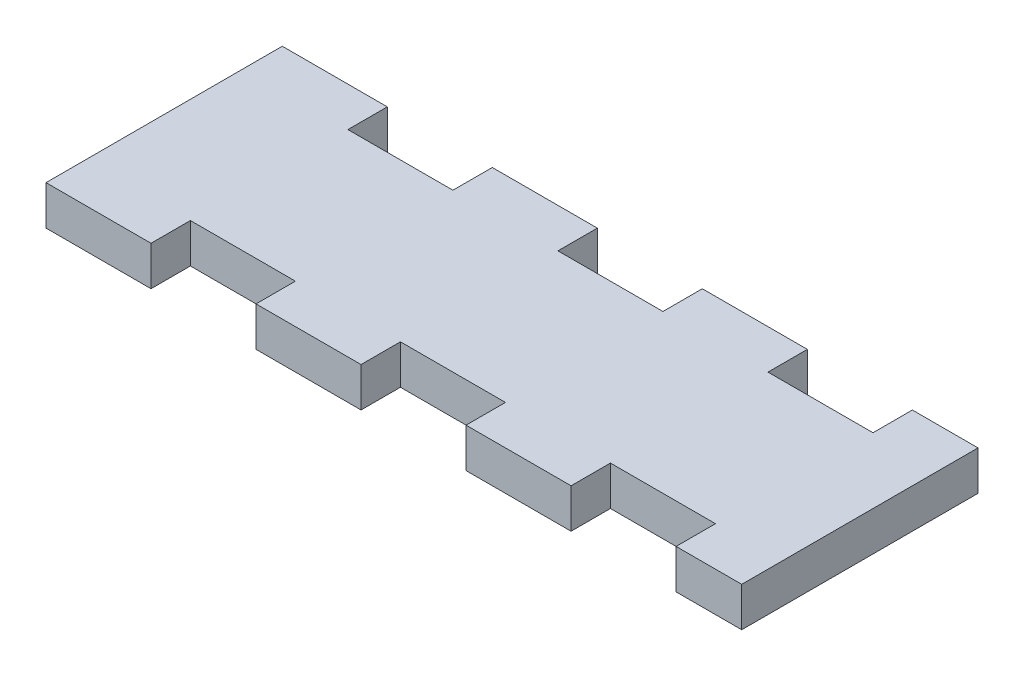
ISO-10303-21;
HEADER;
FILE_DESCRIPTION(('STEP AP214'),'2;1');
FILE_NAME('part.step','',(''),(''),'','','');
FILE_SCHEMA(('AUTOMOTIVE_DESIGN { 1 0 10303 214 1 1 1 1 }'));
ENDSEC;
DATA;
#1=APPLICATION_CONTEXT('core data for automotive mechanical design processes');
#2=APPLICATION_PROTOCOL_DEFINITION('international standard','automotive_design',2000,#1);
#3=PRODUCT_CONTEXT('',#1,'mechanical');
#4=PRODUCT('Part','Part','',(#3));
#5=PRODUCT_RELATED_PRODUCT_CATEGORY('part','',(#4));
#6=PRODUCT_DEFINITION_FORMATION('','',#4);
#7=PRODUCT_DEFINITION_CONTEXT('part definition',#1,'design');
#8=PRODUCT_DEFINITION('design','',#6,#7);
#9=PRODUCT_DEFINITION_SHAPE('','',#8);
#10=(LENGTH_UNIT() NAMED_UNIT(*) SI_UNIT(.MILLI.,.METRE.));
#11=(NAMED_UNIT(*) PLANE_ANGLE_UNIT() SI_UNIT($,.RADIAN.));
#12=(NAMED_UNIT(*) SI_UNIT($,.STERADIAN.) SOLID_ANGLE_UNIT());
#13=UNCERTAINTY_MEASURE_WITH_UNIT(LENGTH_MEASURE(1.E-05),#10,'distance_accuracy_value','');
#14=(GEOMETRIC_REPRESENTATION_CONTEXT(3) GLOBAL_UNCERTAINTY_ASSIGNED_CONTEXT((#13)) GLOBAL_UNIT_ASSIGNED_CONTEXT((#10,
#11,#12)) REPRESENTATION_CONTEXT('',''));
#15=CARTESIAN_POINT('',(0.,0.,0.));
#16=DIRECTION('',(0.,0.,1.));
#17=DIRECTION('',(1.,0.,0.));
#18=AXIS2_PLACEMENT_3D('',#15,#16,#17);
#19=CARTESIAN_POINT('',(0.,3.,0.));
#20=DIRECTION('',(1.,0.,0.));
#21=DIRECTION('',(0.,0.,-1.));
#22=AXIS2_PLACEMENT_3D('',#19,#20,#21);
#23=PLANE('',#22);
#24=DIRECTION('',(0.,0.,1.));
#25=VECTOR('',#24,1.);
#26=CARTESIAN_POINT('',(0.,0.,0.));
#27=LINE('',#26,#25);
#28=CARTESIAN_POINT('',(0.,0.,-17.99971));
#29=VERTEX_POINT('',#28);
#30=CARTESIAN_POINT('',(0.,0.,0.));
#31=VERTEX_POINT('',#30);
#32=EDGE_CURVE('E248',#29,#31,#27,.T.);
#33=ORIENTED_EDGE('',*,*,#32,.T.);
#34=DIRECTION('',(0.,-1.,0.));
#35=VECTOR('',#34,1.);
#36=CARTESIAN_POINT('',(0.,3.,0.));
#37=LINE('',#36,#35);
#38=CARTESIAN_POINT('',(0.,3.,0.));
#39=VERTEX_POINT('',#38);
#40=EDGE_CURVE('E11',#39,#31,#37,.T.);
#41=ORIENTED_EDGE('',*,*,#40,.F.);
#42=DIRECTION('',(0.,0.,1.));
#43=VECTOR('',#42,1.);
#44=CARTESIAN_POINT('',(0.,3.,0.));
#45=LINE('',#44,#43);
#46=CARTESIAN_POINT('',(0.,3.,-17.99971));
#47=VERTEX_POINT('',#46);
#48=EDGE_CURVE('E302',#47,#39,#45,.T.);
#49=ORIENTED_EDGE('',*,*,#48,.F.);
#50=DIRECTION('',(0.,-1.,0.));
#51=VECTOR('',#50,1.);
#52=CARTESIAN_POINT('',(0.,3.,-17.99971));
#53=LINE('',#52,#51);
#54=EDGE_CURVE('E244',#47,#29,#53,.T.);
#55=ORIENTED_EDGE('',*,*,#54,.T.);
#56=EDGE_LOOP('',(#33,#41,#49,#55));
#57=FACE_BOUND('',#56,.T.);
#58=ADVANCED_FACE('F32',(#57),#23,.F.);
#59=CARTESIAN_POINT('',(0.,3.,0.));
#60=DIRECTION('',(0.,0.,-1.));
#61=DIRECTION('',(-1.,0.,0.));
#62=AXIS2_PLACEMENT_3D('',#59,#60,#61);
#63=PLANE('',#62);
#64=DIRECTION('',(1.,0.,0.));
#65=VECTOR('',#64,1.);
#66=CARTESIAN_POINT('',(0.,0.,0.));
#67=LINE('',#66,#65);
#68=CARTESIAN_POINT('',(7.99973000000001,0.,0.));
#69=VERTEX_POINT('',#68);
#70=EDGE_CURVE('E251',#31,#69,#67,.T.);
#71=ORIENTED_EDGE('',*,*,#70,.T.);
#72=DIRECTION('',(0.,-1.,0.));
#73=VECTOR('',#72,1.);
#74=CARTESIAN_POINT('',(7.99973000000001,3.,0.));
#75=LINE('',#74,#73);
#76=CARTESIAN_POINT('',(7.99973000000001,3.,0.));
#77=VERTEX_POINT('',#76);
#78=EDGE_CURVE('E40',#77,#69,#75,.T.);
#79=ORIENTED_EDGE('',*,*,#78,.F.);
#80=DIRECTION('',(1.,0.,0.));
#81=VECTOR('',#80,1.);
#82=CARTESIAN_POINT('',(0.,3.,0.));
#83=LINE('',#82,#81);
#84=EDGE_CURVE('E151',#39,#77,#83,.T.);
#85=ORIENTED_EDGE('',*,*,#84,.F.);
#86=ORIENTED_EDGE('',*,*,#40,.T.);
#87=EDGE_LOOP('',(#71,#79,#85,#86));
#88=FACE_BOUND('',#87,.T.);
#89=ADVANCED_FACE('F460',(#88),#63,.F.);
#90=CARTESIAN_POINT('',(7.99973000000001,3.,-2.999994));
#91=DIRECTION('',(-1.,0.,0.));
#92=DIRECTION('',(0.,0.,1.));
#93=AXIS2_PLACEMENT_3D('',#90,#91,#92);
#94=PLANE('',#93);
#95=DIRECTION('',(0.,0.,-1.));
#96=VECTOR('',#95,1.);
#97=CARTESIAN_POINT('',(7.99973000000001,0.,-2.999994));
#98=LINE('',#97,#96);
#99=CARTESIAN_POINT('',(7.99973000000001,0.,-2.999994));
#100=VERTEX_POINT('',#99);
#101=EDGE_CURVE('E253',#69,#100,#98,.T.);
#102=ORIENTED_EDGE('',*,*,#101,.T.);
#103=DIRECTION('',(0.,-1.,0.));
#104=VECTOR('',#103,1.);
#105=CARTESIAN_POINT('',(7.99973000000001,3.,-2.999994));
#106=LINE('',#105,#104);
#107=CARTESIAN_POINT('',(7.99973000000001,3.,-2.999994));
#108=VERTEX_POINT('',#107);
#109=EDGE_CURVE('E369',#108,#100,#106,.T.);
#110=ORIENTED_EDGE('',*,*,#109,.F.);
#111=DIRECTION('',(0.,0.,-1.));
#112=VECTOR('',#111,1.);
#113=CARTESIAN_POINT('',(7.99973000000001,3.,-2.999994));
#114=LINE('',#113,#112);
#115=EDGE_CURVE('E377',#77,#108,#114,.T.);
#116=ORIENTED_EDGE('',*,*,#115,.F.);
#117=ORIENTED_EDGE('',*,*,#78,.T.);
#118=EDGE_LOOP('',(#102,#110,#116,#117));
#119=FACE_BOUND('',#118,.T.);
#120=ADVANCED_FACE('F375',(#119),#94,.F.);
#121=CARTESIAN_POINT('',(7.99973000000001,3.,-2.999994));
#122=DIRECTION('',(0.,0.,-1.));
#123=DIRECTION('',(-1.,0.,0.));
#124=AXIS2_PLACEMENT_3D('',#121,#122,#123);
#125=PLANE('',#124);
#126=DIRECTION('',(1.,0.,0.));
#127=VECTOR('',#126,1.);
#128=CARTESIAN_POINT('',(7.99973000000001,0.,-2.999994));
#129=LINE('',#128,#127);
#130=CARTESIAN_POINT('',(15.999206,0.,-2.999994));
#131=VERTEX_POINT('',#130);
#132=EDGE_CURVE('E255',#100,#131,#129,.T.);
#133=ORIENTED_EDGE('',*,*,#132,.T.);
#134=DIRECTION('',(0.,-1.,0.));
#135=VECTOR('',#134,1.);
#136=CARTESIAN_POINT('',(15.999206,3.,-2.999994));
#137=LINE('',#136,#135);
#138=CARTESIAN_POINT('',(15.999206,3.,-2.999994));
#139=VERTEX_POINT('',#138);
#140=EDGE_CURVE('E366',#139,#131,#137,.T.);
#141=ORIENTED_EDGE('',*,*,#140,.F.);
#142=DIRECTION('',(1.,0.,0.));
#143=VECTOR('',#142,1.);
#144=CARTESIAN_POINT('',(7.99973000000001,3.,-2.999994));
#145=LINE('',#144,#143);
#146=EDGE_CURVE('E395',#108,#139,#145,.T.);
#147=ORIENTED_EDGE('',*,*,#146,.F.);
#148=ORIENTED_EDGE('',*,*,#109,.T.);
#149=EDGE_LOOP('',(#133,#141,#147,#148));
#150=FACE_BOUND('',#149,.T.);
#151=ADVANCED_FACE('F386',(#150),#125,.F.);
#152=CARTESIAN_POINT('',(15.999206,3.,-2.999994));
#153=DIRECTION('',(1.,0.,0.));
#154=DIRECTION('',(0.,0.,-1.));
#155=AXIS2_PLACEMENT_3D('',#152,#153,#154);
#156=PLANE('',#155);
#157=DIRECTION('',(0.,0.,1.));
#158=VECTOR('',#157,1.);
#159=CARTESIAN_POINT('',(15.999206,0.,-2.999994));
#160=LINE('',#159,#158);
#161=CARTESIAN_POINT('',(15.999206,0.,0.));
#162=VERTEX_POINT('',#161);
#163=EDGE_CURVE('E257',#131,#162,#160,.T.);
#164=ORIENTED_EDGE('',*,*,#163,.T.);
#165=DIRECTION('',(0.,-1.,0.));
#166=VECTOR('',#165,1.);
#167=CARTESIAN_POINT('',(15.999206,3.,0.));
#168=LINE('',#167,#166);
#169=CARTESIAN_POINT('',(15.999206,3.,0.));
#170=VERTEX_POINT('',#169);
#171=EDGE_CURVE('E363',#170,#162,#168,.T.);
#172=ORIENTED_EDGE('',*,*,#171,.F.);
#173=DIRECTION('',(0.,0.,1.));
#174=VECTOR('',#173,1.);
#175=CARTESIAN_POINT('',(15.999206,3.,-2.999994));
#176=LINE('',#175,#174);
#177=EDGE_CURVE('E392',#139,#170,#176,.T.);
#178=ORIENTED_EDGE('',*,*,#177,.F.);
#179=ORIENTED_EDGE('',*,*,#140,.T.);
#180=EDGE_LOOP('',(#164,#172,#178,#179));
#181=FACE_BOUND('',#180,.T.);
#182=ADVANCED_FACE('F390',(#181),#156,.F.);
#183=CARTESIAN_POINT('',(15.999206,3.,0.));
#184=DIRECTION('',(0.,0.,-1.));
#185=DIRECTION('',(-1.,0.,0.));
#186=AXIS2_PLACEMENT_3D('',#183,#184,#185);
#187=PLANE('',#186);
#188=DIRECTION('',(1.,0.,0.));
#189=VECTOR('',#188,1.);
#190=CARTESIAN_POINT('',(15.999206,0.,0.));
#191=LINE('',#190,#189);
#192=CARTESIAN_POINT('',(24.000206,0.,0.));
#193=VERTEX_POINT('',#192);
#194=EDGE_CURVE('E259',#162,#193,#191,.T.);
#195=ORIENTED_EDGE('',*,*,#194,.T.);
#196=DIRECTION('',(0.,-1.,0.));
#197=VECTOR('',#196,1.);
#198=CARTESIAN_POINT('',(24.000206,3.,0.));
#199=LINE('',#198,#197);
#200=CARTESIAN_POINT('',(24.000206,3.,0.));
#201=VERTEX_POINT('',#200);
#202=EDGE_CURVE('E360',#201,#193,#199,.T.);
#203=ORIENTED_EDGE('',*,*,#202,.F.);
#204=DIRECTION('',(1.,0.,0.));
#205=VECTOR('',#204,1.);
#206=CARTESIAN_POINT('',(15.999206,3.,0.));
#207=LINE('',#206,#205);
#208=EDGE_CURVE('E394',#170,#201,#207,.T.);
#209=ORIENTED_EDGE('',*,*,#208,.F.);
#210=ORIENTED_EDGE('',*,*,#171,.T.);
#211=EDGE_LOOP('',(#195,#203,#209,#210));
#212=FACE_BOUND('',#211,.T.);
#213=ADVANCED_FACE('F473',(#212),#187,.F.);
#214=CARTESIAN_POINT('',(24.000206,3.,-2.999994));
#215=DIRECTION('',(-1.,0.,0.));
#216=DIRECTION('',(0.,0.,1.));
#217=AXIS2_PLACEMENT_3D('',#214,#215,#216);
#218=PLANE('',#217);
#219=DIRECTION('',(0.,0.,-1.));
#220=VECTOR('',#219,1.);
#221=CARTESIAN_POINT('',(24.000206,0.,-2.999994));
#222=LINE('',#221,#220);
#223=CARTESIAN_POINT('',(24.000206,0.,-2.999994));
#224=VERTEX_POINT('',#223);
#225=EDGE_CURVE('E261',#193,#224,#222,.T.);
#226=ORIENTED_EDGE('',*,*,#225,.T.);
#227=DIRECTION('',(0.,-1.,0.));
#228=VECTOR('',#227,1.);
#229=CARTESIAN_POINT('',(24.000206,3.,-2.999994));
#230=LINE('',#229,#228);
#231=CARTESIAN_POINT('',(24.000206,3.,-2.999994));
#232=VERTEX_POINT('',#231);
#233=EDGE_CURVE('E357',#232,#224,#230,.T.);
#234=ORIENTED_EDGE('',*,*,#233,.F.);
#235=DIRECTION('',(0.,0.,-1.));
#236=VECTOR('',#235,1.);
#237=CARTESIAN_POINT('',(24.000206,3.,-2.999994));
#238=LINE('',#237,#236);
#239=EDGE_CURVE('E397',#201,#232,#238,.T.);
#240=ORIENTED_EDGE('',*,*,#239,.F.);
#241=ORIENTED_EDGE('',*,*,#202,.T.);
#242=EDGE_LOOP('',(#226,#234,#240,#241));
#243=FACE_BOUND('',#242,.T.);
#244=ADVANCED_FACE('F476',(#243),#218,.F.);
#245=CARTESIAN_POINT('',(24.000206,3.,-2.999994));
#246=DIRECTION('',(0.,0.,-1.));
#247=DIRECTION('',(-1.,0.,0.));
#248=AXIS2_PLACEMENT_3D('',#245,#246,#247);
#249=PLANE('',#248);
#250=DIRECTION('',(1.,0.,0.));
#251=VECTOR('',#250,1.);
#252=CARTESIAN_POINT('',(24.000206,0.,-2.999994));
#253=LINE('',#252,#251);
#254=CARTESIAN_POINT('',(31.999428,0.,-2.999994));
#255=VERTEX_POINT('',#254);
#256=EDGE_CURVE('E263',#224,#255,#253,.T.);
#257=ORIENTED_EDGE('',*,*,#256,.T.);
#258=DIRECTION('',(0.,-1.,0.));
#259=VECTOR('',#258,1.);
#260=CARTESIAN_POINT('',(31.999428,3.,-2.999994));
#261=LINE('',#260,#259);
#262=CARTESIAN_POINT('',(31.999428,3.,-2.999994));
#263=VERTEX_POINT('',#262);
#264=EDGE_CURVE('E354',#263,#255,#261,.T.);
#265=ORIENTED_EDGE('',*,*,#264,.F.);
#266=DIRECTION('',(1.,0.,0.));
#267=VECTOR('',#266,1.);
#268=CARTESIAN_POINT('',(24.000206,3.,-2.999994));
#269=LINE('',#268,#267);
#270=EDGE_CURVE('E403',#232,#263,#269,.T.);
#271=ORIENTED_EDGE('',*,*,#270,.F.);
#272=ORIENTED_EDGE('',*,*,#233,.T.);
#273=EDGE_LOOP('',(#257,#265,#271,#272));
#274=FACE_BOUND('',#273,.T.);
#275=ADVANCED_FACE('F480',(#274),#249,.F.);
#276=CARTESIAN_POINT('',(31.999428,3.,-2.999994));
#277=DIRECTION('',(1.,0.,0.));
#278=DIRECTION('',(0.,0.,-1.));
#279=AXIS2_PLACEMENT_3D('',#276,#277,#278);
#280=PLANE('',#279);
#281=DIRECTION('',(0.,0.,1.));
#282=VECTOR('',#281,1.);
#283=CARTESIAN_POINT('',(31.999428,0.,-2.999994));
#284=LINE('',#283,#282);
#285=CARTESIAN_POINT('',(31.999428,0.,0.));
#286=VERTEX_POINT('',#285);
#287=EDGE_CURVE('E265',#255,#286,#284,.T.);
#288=ORIENTED_EDGE('',*,*,#287,.T.);
#289=DIRECTION('',(0.,-1.,0.));
#290=VECTOR('',#289,1.);
#291=CARTESIAN_POINT('',(31.999428,3.,0.));
#292=LINE('',#291,#290);
#293=CARTESIAN_POINT('',(31.999428,3.,0.));
#294=VERTEX_POINT('',#293);
#295=EDGE_CURVE('E351',#294,#286,#292,.T.);
#296=ORIENTED_EDGE('',*,*,#295,.F.);
#297=DIRECTION('',(0.,0.,1.));
#298=VECTOR('',#297,1.);
#299=CARTESIAN_POINT('',(31.999428,3.,-2.999994));
#300=LINE('',#299,#298);
#301=EDGE_CURVE('E405',#263,#294,#300,.T.);
#302=ORIENTED_EDGE('',*,*,#301,.F.);
#303=ORIENTED_EDGE('',*,*,#264,.T.);
#304=EDGE_LOOP('',(#288,#296,#302,#303));
#305=FACE_BOUND('',#304,.T.);
#306=ADVANCED_FACE('F484',(#305),#280,.F.);
#307=CARTESIAN_POINT('',(31.999428,3.,0.));
#308=DIRECTION('',(0.,0.,-1.));
#309=DIRECTION('',(-1.,0.,0.));
#310=AXIS2_PLACEMENT_3D('',#307,#308,#309);
#311=PLANE('',#310);
#312=DIRECTION('',(1.,0.,0.));
#313=VECTOR('',#312,1.);
#314=CARTESIAN_POINT('',(31.999428,0.,0.));
#315=LINE('',#314,#313);
#316=CARTESIAN_POINT('',(39.999158,0.,0.));
#317=VERTEX_POINT('',#316);
#318=EDGE_CURVE('E267',#286,#317,#315,.T.);
#319=ORIENTED_EDGE('',*,*,#318,.T.);
#320=DIRECTION('',(0.,-1.,0.));
#321=VECTOR('',#320,1.);
#322=CARTESIAN_POINT('',(39.999158,3.,0.));
#323=LINE('',#322,#321);
#324=CARTESIAN_POINT('',(39.999158,3.,0.));
#325=VERTEX_POINT('',#324);
#326=EDGE_CURVE('E348',#325,#317,#323,.T.);
#327=ORIENTED_EDGE('',*,*,#326,.F.);
#328=DIRECTION('',(1.,0.,0.));
#329=VECTOR('',#328,1.);
#330=CARTESIAN_POINT('',(31.999428,3.,0.));
#331=LINE('',#330,#329);
#332=EDGE_CURVE('E407',#294,#325,#331,.T.);
#333=ORIENTED_EDGE('',*,*,#332,.F.);
#334=ORIENTED_EDGE('',*,*,#295,.T.);
#335=EDGE_LOOP('',(#319,#327,#333,#334));
#336=FACE_BOUND('',#335,.T.);
#337=ADVANCED_FACE('F488',(#336),#311,.F.);
#338=CARTESIAN_POINT('',(39.999158,3.,-2.999994));
#339=DIRECTION('',(-1.,0.,0.));
#340=DIRECTION('',(0.,0.,1.));
#341=AXIS2_PLACEMENT_3D('',#338,#339,#340);
#342=PLANE('',#341);
#343=DIRECTION('',(0.,0.,-1.));
#344=VECTOR('',#343,1.);
#345=CARTESIAN_POINT('',(39.999158,0.,-2.999994));
#346=LINE('',#345,#344);
#347=CARTESIAN_POINT('',(39.999158,0.,-2.999994));
#348=VERTEX_POINT('',#347);
#349=EDGE_CURVE('E269',#317,#348,#346,.T.);
#350=ORIENTED_EDGE('',*,*,#349,.T.);
#351=DIRECTION('',(0.,-1.,0.));
#352=VECTOR('',#351,1.);
#353=CARTESIAN_POINT('',(39.999158,3.,-2.999994));
#354=LINE('',#353,#352);
#355=CARTESIAN_POINT('',(39.999158,3.,-2.999994));
#356=VERTEX_POINT('',#355);
#357=EDGE_CURVE('E345',#356,#348,#354,.T.);
#358=ORIENTED_EDGE('',*,*,#357,.F.);
#359=DIRECTION('',(0.,0.,-1.));
#360=VECTOR('',#359,1.);
#361=CARTESIAN_POINT('',(39.999158,3.,-2.999994));
#362=LINE('',#361,#360);
#363=EDGE_CURVE('E409',#325,#356,#362,.T.);
#364=ORIENTED_EDGE('',*,*,#363,.F.);
#365=ORIENTED_EDGE('',*,*,#326,.T.);
#366=EDGE_LOOP('',(#350,#358,#364,#365));
#367=FACE_BOUND('',#366,.T.);
#368=ADVANCED_FACE('F492',(#367),#342,.F.);
#369=CARTESIAN_POINT('',(39.999158,3.,-2.999994));
#370=DIRECTION('',(0.,0.,-1.));
#371=DIRECTION('',(-1.,0.,0.));
#372=AXIS2_PLACEMENT_3D('',#369,#370,#371);
#373=PLANE('',#372);
#374=DIRECTION('',(1.,0.,0.));
#375=VECTOR('',#374,1.);
#376=CARTESIAN_POINT('',(39.999158,0.,-2.999994));
#377=LINE('',#376,#375);
#378=CARTESIAN_POINT('',(48.000158,0.,-2.999994));
#379=VERTEX_POINT('',#378);
#380=EDGE_CURVE('E271',#348,#379,#377,.T.);
#381=ORIENTED_EDGE('',*,*,#380,.T.);
#382=DIRECTION('',(0.,-1.,0.));
#383=VECTOR('',#382,1.);
#384=CARTESIAN_POINT('',(48.000158,3.,-2.999994));
#385=LINE('',#384,#383);
#386=CARTESIAN_POINT('',(48.000158,3.,-2.999994));
#387=VERTEX_POINT('',#386);
#388=EDGE_CURVE('E342',#387,#379,#385,.T.);
#389=ORIENTED_EDGE('',*,*,#388,.F.);
#390=DIRECTION('',(1.,0.,0.));
#391=VECTOR('',#390,1.);
#392=CARTESIAN_POINT('',(39.999158,3.,-2.999994));
#393=LINE('',#392,#391);
#394=EDGE_CURVE('E411',#356,#387,#393,.T.);
#395=ORIENTED_EDGE('',*,*,#394,.F.);
#396=ORIENTED_EDGE('',*,*,#357,.T.);
#397=EDGE_LOOP('',(#381,#389,#395,#396));
#398=FACE_BOUND('',#397,.T.);
#399=ADVANCED_FACE('F496',(#398),#373,.F.);
#400=CARTESIAN_POINT('',(48.000158,3.,-2.999994));
#401=DIRECTION('',(1.,0.,0.));
#402=DIRECTION('',(0.,0.,-1.));
#403=AXIS2_PLACEMENT_3D('',#400,#401,#402);
#404=PLANE('',#403);
#405=DIRECTION('',(0.,0.,1.));
#406=VECTOR('',#405,1.);
#407=CARTESIAN_POINT('',(48.000158,0.,-2.999994));
#408=LINE('',#407,#406);
#409=CARTESIAN_POINT('',(48.000158,0.,0.));
#410=VERTEX_POINT('',#409);
#411=EDGE_CURVE('E273',#379,#410,#408,.T.);
#412=ORIENTED_EDGE('',*,*,#411,.T.);
#413=DIRECTION('',(0.,-1.,0.));
#414=VECTOR('',#413,1.);
#415=CARTESIAN_POINT('',(48.000158,3.,0.));
#416=LINE('',#415,#414);
#417=CARTESIAN_POINT('',(48.000158,3.,0.));
#418=VERTEX_POINT('',#417);
#419=EDGE_CURVE('E339',#418,#410,#416,.T.);
#420=ORIENTED_EDGE('',*,*,#419,.F.);
#421=DIRECTION('',(0.,0.,1.));
#422=VECTOR('',#421,1.);
#423=CARTESIAN_POINT('',(48.000158,3.,-2.999994));
#424=LINE('',#423,#422);
#425=EDGE_CURVE('E413',#387,#418,#424,.T.);
#426=ORIENTED_EDGE('',*,*,#425,.F.);
#427=ORIENTED_EDGE('',*,*,#388,.T.);
#428=EDGE_LOOP('',(#412,#420,#426,#427));
#429=FACE_BOUND('',#428,.T.);
#430=ADVANCED_FACE('F500',(#429),#404,.F.);
#431=CARTESIAN_POINT('',(48.000158,3.,0.));
#432=DIRECTION('',(0.,0.,-1.));
#433=DIRECTION('',(-1.,0.,0.));
#434=AXIS2_PLACEMENT_3D('',#431,#432,#433);
#435=PLANE('',#434);
#436=DIRECTION('',(1.,0.,0.));
#437=VECTOR('',#436,1.);
#438=CARTESIAN_POINT('',(48.000158,0.,0.));
#439=LINE('',#438,#437);
#440=CARTESIAN_POINT('',(52.99964,0.,0.));
#441=VERTEX_POINT('',#440);
#442=EDGE_CURVE('E275',#410,#441,#439,.T.);
#443=ORIENTED_EDGE('',*,*,#442,.T.);
#444=DIRECTION('',(0.,-1.,0.));
#445=VECTOR('',#444,1.);
#446=CARTESIAN_POINT('',(52.99964,3.,0.));
#447=LINE('',#446,#445);
#448=CARTESIAN_POINT('',(52.99964,3.,0.));
#449=VERTEX_POINT('',#448);
#450=EDGE_CURVE('E336',#449,#441,#447,.T.);
#451=ORIENTED_EDGE('',*,*,#450,.F.);
#452=DIRECTION('',(1.,0.,0.));
#453=VECTOR('',#452,1.);
#454=CARTESIAN_POINT('',(48.000158,3.,0.));
#455=LINE('',#454,#453);
#456=EDGE_CURVE('E415',#418,#449,#455,.T.);
#457=ORIENTED_EDGE('',*,*,#456,.F.);
#458=ORIENTED_EDGE('',*,*,#419,.T.);
#459=EDGE_LOOP('',(#443,#451,#457,#458));
#460=FACE_BOUND('',#459,.T.);
#461=ADVANCED_FACE('F504',(#460),#435,.F.);
#462=CARTESIAN_POINT('',(52.99964,3.,0.));
#463=DIRECTION('',(-1.,0.,0.));
#464=DIRECTION('',(0.,0.,1.));
#465=AXIS2_PLACEMENT_3D('',#462,#463,#464);
#466=PLANE('',#465);
#467=DIRECTION('',(0.,0.,-1.));
#468=VECTOR('',#467,1.);
#469=CARTESIAN_POINT('',(52.99964,0.,0.));
#470=LINE('',#469,#468);
#471=CARTESIAN_POINT('',(52.99964,0.,-17.99971));
#472=VERTEX_POINT('',#471);
#473=EDGE_CURVE('E277',#441,#472,#470,.T.);
#474=ORIENTED_EDGE('',*,*,#473,.T.);
#475=DIRECTION('',(0.,-1.,0.));
#476=VECTOR('',#475,1.);
#477=CARTESIAN_POINT('',(52.99964,3.,-17.99971));
#478=LINE('',#477,#476);
#479=CARTESIAN_POINT('',(52.99964,3.,-17.99971));
#480=VERTEX_POINT('',#479);
#481=EDGE_CURVE('E333',#480,#472,#478,.T.);
#482=ORIENTED_EDGE('',*,*,#481,.F.);
#483=DIRECTION('',(0.,0.,-1.));
#484=VECTOR('',#483,1.);
#485=CARTESIAN_POINT('',(52.99964,3.,0.));
#486=LINE('',#485,#484);
#487=EDGE_CURVE('E417',#449,#480,#486,.T.);
#488=ORIENTED_EDGE('',*,*,#487,.F.);
#489=ORIENTED_EDGE('',*,*,#450,.T.);
#490=EDGE_LOOP('',(#474,#482,#488,#489));
#491=FACE_BOUND('',#490,.T.);
#492=ADVANCED_FACE('F508',(#491),#466,.F.);
#493=CARTESIAN_POINT('',(48.000158,3.,-17.99971));
#494=DIRECTION('',(0.,0.,1.));
#495=DIRECTION('',(1.,0.,0.));
#496=AXIS2_PLACEMENT_3D('',#493,#494,#495);
#497=PLANE('',#496);
#498=DIRECTION('',(-1.,0.,0.));
#499=VECTOR('',#498,1.);
#500=CARTESIAN_POINT('',(48.000158,0.,-17.99971));
#501=LINE('',#500,#499);
#502=CARTESIAN_POINT('',(48.000158,0.,-17.99971));
#503=VERTEX_POINT('',#502);
#504=EDGE_CURVE('E279',#472,#503,#501,.T.);
#505=ORIENTED_EDGE('',*,*,#504,.T.);
#506=DIRECTION('',(0.,-1.,0.));
#507=VECTOR('',#506,1.);
#508=CARTESIAN_POINT('',(48.000158,3.,-17.99971));
#509=LINE('',#508,#507);
#510=CARTESIAN_POINT('',(48.000158,3.,-17.99971));
#511=VERTEX_POINT('',#510);
#512=EDGE_CURVE('E330',#511,#503,#509,.T.);
#513=ORIENTED_EDGE('',*,*,#512,.F.);
#514=DIRECTION('',(-1.,0.,0.));
#515=VECTOR('',#514,1.);
#516=CARTESIAN_POINT('',(48.000158,3.,-17.99971));
#517=LINE('',#516,#515);
#518=EDGE_CURVE('E419',#480,#511,#517,.T.);
#519=ORIENTED_EDGE('',*,*,#518,.F.);
#520=ORIENTED_EDGE('',*,*,#481,.T.);
#521=EDGE_LOOP('',(#505,#513,#519,#520));
#522=FACE_BOUND('',#521,.T.);
#523=ADVANCED_FACE('F512',(#522),#497,.F.);
#524=CARTESIAN_POINT('',(48.000158,3.,-17.99971));
#525=DIRECTION('',(1.,0.,0.));
#526=DIRECTION('',(0.,0.,-1.));
#527=AXIS2_PLACEMENT_3D('',#524,#525,#526);
#528=PLANE('',#527);
#529=DIRECTION('',(0.,0.,1.));
#530=VECTOR('',#529,1.);
#531=CARTESIAN_POINT('',(48.000158,0.,-17.99971));
#532=LINE('',#531,#530);
#533=CARTESIAN_POINT('',(48.000158,0.,-14.999716));
#534=VERTEX_POINT('',#533);
#535=EDGE_CURVE('E281',#503,#534,#532,.T.);
#536=ORIENTED_EDGE('',*,*,#535,.T.);
#537=DIRECTION('',(0.,-1.,0.));
#538=VECTOR('',#537,1.);
#539=CARTESIAN_POINT('',(48.000158,3.,-14.999716));
#540=LINE('',#539,#538);
#541=CARTESIAN_POINT('',(48.000158,3.,-14.999716));
#542=VERTEX_POINT('',#541);
#543=EDGE_CURVE('E327',#542,#534,#540,.T.);
#544=ORIENTED_EDGE('',*,*,#543,.F.);
#545=DIRECTION('',(0.,0.,1.));
#546=VECTOR('',#545,1.);
#547=CARTESIAN_POINT('',(48.000158,3.,-17.99971));
#548=LINE('',#547,#546);
#549=EDGE_CURVE('E421',#511,#542,#548,.T.);
#550=ORIENTED_EDGE('',*,*,#549,.F.);
#551=ORIENTED_EDGE('',*,*,#512,.T.);
#552=EDGE_LOOP('',(#536,#544,#550,#551));
#553=FACE_BOUND('',#552,.T.);
#554=ADVANCED_FACE('F516',(#553),#528,.F.);
#555=CARTESIAN_POINT('',(39.999158,3.,-14.999716));
#556=DIRECTION('',(0.,0.,1.));
#557=DIRECTION('',(1.,0.,0.));
#558=AXIS2_PLACEMENT_3D('',#555,#556,#557);
#559=PLANE('',#558);
#560=DIRECTION('',(-1.,0.,0.));
#561=VECTOR('',#560,1.);
#562=CARTESIAN_POINT('',(39.999158,0.,-14.999716));
#563=LINE('',#562,#561);
#564=CARTESIAN_POINT('',(39.999158,0.,-14.999716));
#565=VERTEX_POINT('',#564);
#566=EDGE_CURVE('E283',#534,#565,#563,.T.);
#567=ORIENTED_EDGE('',*,*,#566,.T.);
#568=DIRECTION('',(0.,-1.,0.));
#569=VECTOR('',#568,1.);
#570=CARTESIAN_POINT('',(39.999158,3.,-14.999716));
#571=LINE('',#570,#569);
#572=CARTESIAN_POINT('',(39.999158,3.,-14.999716));
#573=VERTEX_POINT('',#572);
#574=EDGE_CURVE('E324',#573,#565,#571,.T.);
#575=ORIENTED_EDGE('',*,*,#574,.F.);
#576=DIRECTION('',(-1.,0.,0.));
#577=VECTOR('',#576,1.);
#578=CARTESIAN_POINT('',(39.999158,3.,-14.999716));
#579=LINE('',#578,#577);
#580=EDGE_CURVE('E423',#542,#573,#579,.T.);
#581=ORIENTED_EDGE('',*,*,#580,.F.);
#582=ORIENTED_EDGE('',*,*,#543,.T.);
#583=EDGE_LOOP('',(#567,#575,#581,#582));
#584=FACE_BOUND('',#583,.T.);
#585=ADVANCED_FACE('F520',(#584),#559,.F.);
#586=CARTESIAN_POINT('',(39.999158,3.,-17.99971));
#587=DIRECTION('',(-1.,0.,0.));
#588=DIRECTION('',(0.,0.,1.));
#589=AXIS2_PLACEMENT_3D('',#586,#587,#588);
#590=PLANE('',#589);
#591=DIRECTION('',(0.,0.,-1.));
#592=VECTOR('',#591,1.);
#593=CARTESIAN_POINT('',(39.999158,0.,-17.99971));
#594=LINE('',#593,#592);
#595=CARTESIAN_POINT('',(39.999158,0.,-17.99971));
#596=VERTEX_POINT('',#595);
#597=EDGE_CURVE('E285',#565,#596,#594,.T.);
#598=ORIENTED_EDGE('',*,*,#597,.T.);
#599=DIRECTION('',(0.,-1.,0.));
#600=VECTOR('',#599,1.);
#601=CARTESIAN_POINT('',(39.999158,3.,-17.99971));
#602=LINE('',#601,#600);
#603=CARTESIAN_POINT('',(39.999158,3.,-17.99971));
#604=VERTEX_POINT('',#603);
#605=EDGE_CURVE('E321',#604,#596,#602,.T.);
#606=ORIENTED_EDGE('',*,*,#605,.F.);
#607=DIRECTION('',(0.,0.,-1.));
#608=VECTOR('',#607,1.);
#609=CARTESIAN_POINT('',(39.999158,3.,-17.99971));
#610=LINE('',#609,#608);
#611=EDGE_CURVE('E425',#573,#604,#610,.T.);
#612=ORIENTED_EDGE('',*,*,#611,.F.);
#613=ORIENTED_EDGE('',*,*,#574,.T.);
#614=EDGE_LOOP('',(#598,#606,#612,#613));
#615=FACE_BOUND('',#614,.T.);
#616=ADVANCED_FACE('F524',(#615),#590,.F.);
#617=CARTESIAN_POINT('',(31.999428,3.,-17.99971));
#618=DIRECTION('',(0.,0.,1.));
#619=DIRECTION('',(1.,0.,0.));
#620=AXIS2_PLACEMENT_3D('',#617,#618,#619);
#621=PLANE('',#620);
#622=DIRECTION('',(-1.,0.,0.));
#623=VECTOR('',#622,1.);
#624=CARTESIAN_POINT('',(31.999428,0.,-17.99971));
#625=LINE('',#624,#623);
#626=CARTESIAN_POINT('',(31.999428,0.,-17.99971));
#627=VERTEX_POINT('',#626);
#628=EDGE_CURVE('E287',#596,#627,#625,.T.);
#629=ORIENTED_EDGE('',*,*,#628,.T.);
#630=DIRECTION('',(0.,-1.,0.));
#631=VECTOR('',#630,1.);
#632=CARTESIAN_POINT('',(31.999428,3.,-17.99971));
#633=LINE('',#632,#631);
#634=CARTESIAN_POINT('',(31.999428,3.,-17.99971));
#635=VERTEX_POINT('',#634);
#636=EDGE_CURVE('E318',#635,#627,#633,.T.);
#637=ORIENTED_EDGE('',*,*,#636,.F.);
#638=DIRECTION('',(-1.,0.,0.));
#639=VECTOR('',#638,1.);
#640=CARTESIAN_POINT('',(31.999428,3.,-17.99971));
#641=LINE('',#640,#639);
#642=EDGE_CURVE('E427',#604,#635,#641,.T.);
#643=ORIENTED_EDGE('',*,*,#642,.F.);
#644=ORIENTED_EDGE('',*,*,#605,.T.);
#645=EDGE_LOOP('',(#629,#637,#643,#644));
#646=FACE_BOUND('',#645,.T.);
#647=ADVANCED_FACE('F528',(#646),#621,.F.);
#648=CARTESIAN_POINT('',(31.999428,3.,-17.99971));
#649=DIRECTION('',(1.,0.,0.));
#650=DIRECTION('',(0.,0.,-1.));
#651=AXIS2_PLACEMENT_3D('',#648,#649,#650);
#652=PLANE('',#651);
#653=DIRECTION('',(0.,0.,1.));
#654=VECTOR('',#653,1.);
#655=CARTESIAN_POINT('',(31.999428,0.,-17.99971));
#656=LINE('',#655,#654);
#657=CARTESIAN_POINT('',(31.999428,0.,-14.999716));
#658=VERTEX_POINT('',#657);
#659=EDGE_CURVE('E289',#627,#658,#656,.T.);
#660=ORIENTED_EDGE('',*,*,#659,.T.);
#661=DIRECTION('',(0.,-1.,0.));
#662=VECTOR('',#661,1.);
#663=CARTESIAN_POINT('',(31.999428,3.,-14.999716));
#664=LINE('',#663,#662);
#665=CARTESIAN_POINT('',(31.999428,3.,-14.999716));
#666=VERTEX_POINT('',#665);
#667=EDGE_CURVE('E315',#666,#658,#664,.T.);
#668=ORIENTED_EDGE('',*,*,#667,.F.);
#669=DIRECTION('',(0.,0.,1.));
#670=VECTOR('',#669,1.);
#671=CARTESIAN_POINT('',(31.999428,3.,-17.99971));
#672=LINE('',#671,#670);
#673=EDGE_CURVE('E429',#635,#666,#672,.T.);
#674=ORIENTED_EDGE('',*,*,#673,.F.);
#675=ORIENTED_EDGE('',*,*,#636,.T.);
#676=EDGE_LOOP('',(#660,#668,#674,#675));
#677=FACE_BOUND('',#676,.T.);
#678=ADVANCED_FACE('F532',(#677),#652,.F.);
#679=CARTESIAN_POINT('',(24.000206,3.,-14.999716));
#680=DIRECTION('',(0.,0.,1.));
#681=DIRECTION('',(1.,0.,0.));
#682=AXIS2_PLACEMENT_3D('',#679,#680,#681);
#683=PLANE('',#682);
#684=DIRECTION('',(-1.,0.,0.));
#685=VECTOR('',#684,1.);
#686=CARTESIAN_POINT('',(24.000206,0.,-14.999716));
#687=LINE('',#686,#685);
#688=CARTESIAN_POINT('',(24.000206,0.,-14.999716));
#689=VERTEX_POINT('',#688);
#690=EDGE_CURVE('E291',#658,#689,#687,.T.);
#691=ORIENTED_EDGE('',*,*,#690,.T.);
#692=DIRECTION('',(0.,-1.,0.));
#693=VECTOR('',#692,1.);
#694=CARTESIAN_POINT('',(24.000206,3.,-14.999716));
#695=LINE('',#694,#693);
#696=CARTESIAN_POINT('',(24.000206,3.,-14.999716));
#697=VERTEX_POINT('',#696);
#698=EDGE_CURVE('E312',#697,#689,#695,.T.);
#699=ORIENTED_EDGE('',*,*,#698,.F.);
#700=DIRECTION('',(-1.,0.,0.));
#701=VECTOR('',#700,1.);
#702=CARTESIAN_POINT('',(24.000206,3.,-14.999716));
#703=LINE('',#702,#701);
#704=EDGE_CURVE('E431',#666,#697,#703,.T.);
#705=ORIENTED_EDGE('',*,*,#704,.F.);
#706=ORIENTED_EDGE('',*,*,#667,.T.);
#707=EDGE_LOOP('',(#691,#699,#705,#706));
#708=FACE_BOUND('',#707,.T.);
#709=ADVANCED_FACE('F536',(#708),#683,.F.);
#710=CARTESIAN_POINT('',(24.000206,3.,-17.99971));
#711=DIRECTION('',(-1.,0.,0.));
#712=DIRECTION('',(0.,0.,1.));
#713=AXIS2_PLACEMENT_3D('',#710,#711,#712);
#714=PLANE('',#713);
#715=DIRECTION('',(0.,0.,-1.));
#716=VECTOR('',#715,1.);
#717=CARTESIAN_POINT('',(24.000206,0.,-17.99971));
#718=LINE('',#717,#716);
#719=CARTESIAN_POINT('',(24.000206,0.,-17.99971));
#720=VERTEX_POINT('',#719);
#721=EDGE_CURVE('E293',#689,#720,#718,.T.);
#722=ORIENTED_EDGE('',*,*,#721,.T.);
#723=DIRECTION('',(0.,-1.,0.));
#724=VECTOR('',#723,1.);
#725=CARTESIAN_POINT('',(24.000206,3.,-17.99971));
#726=LINE('',#725,#724);
#727=CARTESIAN_POINT('',(24.000206,3.,-17.99971));
#728=VERTEX_POINT('',#727);
#729=EDGE_CURVE('E309',#728,#720,#726,.T.);
#730=ORIENTED_EDGE('',*,*,#729,.F.);
#731=DIRECTION('',(0.,0.,-1.));
#732=VECTOR('',#731,1.);
#733=CARTESIAN_POINT('',(24.000206,3.,-17.99971));
#734=LINE('',#733,#732);
#735=EDGE_CURVE('E433',#697,#728,#734,.T.);
#736=ORIENTED_EDGE('',*,*,#735,.F.);
#737=ORIENTED_EDGE('',*,*,#698,.T.);
#738=EDGE_LOOP('',(#722,#730,#736,#737));
#739=FACE_BOUND('',#738,.T.);
#740=ADVANCED_FACE('F540',(#739),#714,.F.);
#741=CARTESIAN_POINT('',(15.999206,3.,-17.99971));
#742=DIRECTION('',(0.,0.,1.));
#743=DIRECTION('',(1.,0.,0.));
#744=AXIS2_PLACEMENT_3D('',#741,#742,#743);
#745=PLANE('',#744);
#746=DIRECTION('',(-1.,0.,0.));
#747=VECTOR('',#746,1.);
#748=CARTESIAN_POINT('',(15.999206,0.,-17.99971));
#749=LINE('',#748,#747);
#750=CARTESIAN_POINT('',(15.999206,0.,-17.99971));
#751=VERTEX_POINT('',#750);
#752=EDGE_CURVE('E295',#720,#751,#749,.T.);
#753=ORIENTED_EDGE('',*,*,#752,.T.);
#754=DIRECTION('',(0.,-1.,0.));
#755=VECTOR('',#754,1.);
#756=CARTESIAN_POINT('',(15.999206,3.,-17.99971));
#757=LINE('',#756,#755);
#758=CARTESIAN_POINT('',(15.999206,3.,-17.99971));
#759=VERTEX_POINT('',#758);
#760=EDGE_CURVE('E306',#759,#751,#757,.T.);
#761=ORIENTED_EDGE('',*,*,#760,.F.);
#762=DIRECTION('',(-1.,0.,0.));
#763=VECTOR('',#762,1.);
#764=CARTESIAN_POINT('',(15.999206,3.,-17.99971));
#765=LINE('',#764,#763);
#766=EDGE_CURVE('E435',#728,#759,#765,.T.);
#767=ORIENTED_EDGE('',*,*,#766,.F.);
#768=ORIENTED_EDGE('',*,*,#729,.T.);
#769=EDGE_LOOP('',(#753,#761,#767,#768));
#770=FACE_BOUND('',#769,.T.);
#771=ADVANCED_FACE('F441',(#770),#745,.F.);
#772=CARTESIAN_POINT('',(15.999206,3.,-17.99971));
#773=DIRECTION('',(1.,0.,0.));
#774=DIRECTION('',(0.,0.,-1.));
#775=AXIS2_PLACEMENT_3D('',#772,#773,#774);
#776=PLANE('',#775);
#777=DIRECTION('',(0.,0.,1.));
#778=VECTOR('',#777,1.);
#779=CARTESIAN_POINT('',(15.999206,0.,-17.99971));
#780=LINE('',#779,#778);
#781=CARTESIAN_POINT('',(15.999206,0.,-14.999716));
#782=VERTEX_POINT('',#781);
#783=EDGE_CURVE('E297',#751,#782,#780,.T.);
#784=ORIENTED_EDGE('',*,*,#783,.T.);
#785=DIRECTION('',(0.,-1.,0.));
#786=VECTOR('',#785,1.);
#787=CARTESIAN_POINT('',(15.999206,3.,-14.999716));
#788=LINE('',#787,#786);
#789=CARTESIAN_POINT('',(15.999206,3.,-14.999716));
#790=VERTEX_POINT('',#789);
#791=EDGE_CURVE('E239',#790,#782,#788,.T.);
#792=ORIENTED_EDGE('',*,*,#791,.F.);
#793=DIRECTION('',(0.,0.,1.));
#794=VECTOR('',#793,1.);
#795=CARTESIAN_POINT('',(15.999206,3.,-17.99971));
#796=LINE('',#795,#794);
#797=EDGE_CURVE('E230',#759,#790,#796,.T.);
#798=ORIENTED_EDGE('',*,*,#797,.F.);
#799=ORIENTED_EDGE('',*,*,#760,.T.);
#800=EDGE_LOOP('',(#784,#792,#798,#799));
#801=FACE_BOUND('',#800,.T.);
#802=ADVANCED_FACE('F445',(#801),#776,.F.);
#803=CARTESIAN_POINT('',(7.99973000000001,3.,-14.999716));
#804=DIRECTION('',(0.,0.,1.));
#805=DIRECTION('',(1.,0.,0.));
#806=AXIS2_PLACEMENT_3D('',#803,#804,#805);
#807=PLANE('',#806);
#808=DIRECTION('',(-1.,0.,0.));
#809=VECTOR('',#808,1.);
#810=CARTESIAN_POINT('',(7.99973000000001,0.,-14.999716));
#811=LINE('',#810,#809);
#812=CARTESIAN_POINT('',(7.99973000000001,0.,-14.999716));
#813=VERTEX_POINT('',#812);
#814=EDGE_CURVE('E238',#782,#813,#811,.T.);
#815=ORIENTED_EDGE('',*,*,#814,.T.);
#816=DIRECTION('',(0.,-1.,0.));
#817=VECTOR('',#816,1.);
#818=CARTESIAN_POINT('',(7.99973000000001,3.,-14.999716));
#819=LINE('',#818,#817);
#820=CARTESIAN_POINT('',(7.99973000000001,3.,-14.999716));
#821=VERTEX_POINT('',#820);
#822=EDGE_CURVE('E235',#821,#813,#819,.T.);
#823=ORIENTED_EDGE('',*,*,#822,.F.);
#824=DIRECTION('',(-1.,0.,0.));
#825=VECTOR('',#824,1.);
#826=CARTESIAN_POINT('',(7.99973000000001,3.,-14.999716));
#827=LINE('',#826,#825);
#828=EDGE_CURVE('E224',#790,#821,#827,.T.);
#829=ORIENTED_EDGE('',*,*,#828,.F.);
#830=ORIENTED_EDGE('',*,*,#791,.T.);
#831=EDGE_LOOP('',(#815,#823,#829,#830));
#832=FACE_BOUND('',#831,.T.);
#833=ADVANCED_FACE('F236',(#832),#807,.F.);
#834=CARTESIAN_POINT('',(7.99973000000001,3.,-17.99971));
#835=DIRECTION('',(-1.,0.,0.));
#836=DIRECTION('',(0.,0.,1.));
#837=AXIS2_PLACEMENT_3D('',#834,#835,#836);
#838=PLANE('',#837);
#839=DIRECTION('',(0.,0.,-1.));
#840=VECTOR('',#839,1.);
#841=CARTESIAN_POINT('',(7.99973000000001,0.,-17.99971));
#842=LINE('',#841,#840);
#843=CARTESIAN_POINT('',(7.99973000000001,0.,-17.99971));
#844=VERTEX_POINT('',#843);
#845=EDGE_CURVE('E137',#813,#844,#842,.T.);
#846=ORIENTED_EDGE('',*,*,#845,.T.);
#847=DIRECTION('',(0.,-1.,0.));
#848=VECTOR('',#847,1.);
#849=CARTESIAN_POINT('',(7.99973000000001,3.,-17.99971));
#850=LINE('',#849,#848);
#851=CARTESIAN_POINT('',(7.99973000000001,3.,-17.99971));
#852=VERTEX_POINT('',#851);
#853=EDGE_CURVE('E240',#852,#844,#850,.T.);
#854=ORIENTED_EDGE('',*,*,#853,.F.);
#855=DIRECTION('',(0.,0.,-1.));
#856=VECTOR('',#855,1.);
#857=CARTESIAN_POINT('',(7.99973000000001,3.,-17.99971));
#858=LINE('',#857,#856);
#859=EDGE_CURVE('E228',#821,#852,#858,.T.);
#860=ORIENTED_EDGE('',*,*,#859,.F.);
#861=ORIENTED_EDGE('',*,*,#822,.T.);
#862=EDGE_LOOP('',(#846,#854,#860,#861));
#863=FACE_BOUND('',#862,.T.);
#864=ADVANCED_FACE('F242',(#863),#838,.F.);
#865=CARTESIAN_POINT('',(0.,3.,-17.99971));
#866=DIRECTION('',(0.,0.,1.));
#867=DIRECTION('',(1.,0.,0.));
#868=AXIS2_PLACEMENT_3D('',#865,#866,#867);
#869=PLANE('',#868);
#870=DIRECTION('',(-1.,0.,0.));
#871=VECTOR('',#870,1.);
#872=CARTESIAN_POINT('',(0.,0.,-17.99971));
#873=LINE('',#872,#871);
#874=EDGE_CURVE('E143',#844,#29,#873,.T.);
#875=ORIENTED_EDGE('',*,*,#874,.T.);
#876=ORIENTED_EDGE('',*,*,#54,.F.);
#877=DIRECTION('',(-1.,0.,0.));
#878=VECTOR('',#877,1.);
#879=CARTESIAN_POINT('',(0.,3.,-17.99971));
#880=LINE('',#879,#878);
#881=EDGE_CURVE('E48',#852,#47,#880,.T.);
#882=ORIENTED_EDGE('',*,*,#881,.F.);
#883=ORIENTED_EDGE('',*,*,#853,.T.);
#884=EDGE_LOOP('',(#875,#876,#882,#883));
#885=FACE_BOUND('',#884,.T.);
#886=ADVANCED_FACE('F449',(#885),#869,.F.);
#887=CARTESIAN_POINT('',(0.,3.,0.));
#888=DIRECTION('',(0.,-1.,0.));
#889=DIRECTION('',(0.,0.,-1.));
#890=AXIS2_PLACEMENT_3D('',#887,#888,#889);
#891=PLANE('',#890);
#892=ORIENTED_EDGE('',*,*,#48,.T.);
#893=ORIENTED_EDGE('',*,*,#84,.T.);
#894=ORIENTED_EDGE('',*,*,#115,.T.);
#895=ORIENTED_EDGE('',*,*,#146,.T.);
#896=ORIENTED_EDGE('',*,*,#177,.T.);
#897=ORIENTED_EDGE('',*,*,#208,.T.);
#898=ORIENTED_EDGE('',*,*,#239,.T.);
#899=ORIENTED_EDGE('',*,*,#270,.T.);
#900=ORIENTED_EDGE('',*,*,#301,.T.);
#901=ORIENTED_EDGE('',*,*,#332,.T.);
#902=ORIENTED_EDGE('',*,*,#363,.T.);
#903=ORIENTED_EDGE('',*,*,#394,.T.);
#904=ORIENTED_EDGE('',*,*,#425,.T.);
#905=ORIENTED_EDGE('',*,*,#456,.T.);
#906=ORIENTED_EDGE('',*,*,#487,.T.);
#907=ORIENTED_EDGE('',*,*,#518,.T.);
#908=ORIENTED_EDGE('',*,*,#549,.T.);
#909=ORIENTED_EDGE('',*,*,#580,.T.);
#910=ORIENTED_EDGE('',*,*,#611,.T.);
#911=ORIENTED_EDGE('',*,*,#642,.T.);
#912=ORIENTED_EDGE('',*,*,#673,.T.);
#913=ORIENTED_EDGE('',*,*,#704,.T.);
#914=ORIENTED_EDGE('',*,*,#735,.T.);
#915=ORIENTED_EDGE('',*,*,#766,.T.);
#916=ORIENTED_EDGE('',*,*,#797,.T.);
#917=ORIENTED_EDGE('',*,*,#828,.T.);
#918=ORIENTED_EDGE('',*,*,#859,.T.);
#919=ORIENTED_EDGE('',*,*,#881,.T.);
#920=EDGE_LOOP('',(#892,#893,#894,#895,#896,#897,#898,#899,#900,#901,#902,#903,#904,#905,#906,
#907,#908,#909,#910,#911,#912,#913,#914,#915,#916,#917,#918,#919));
#921=FACE_BOUND('',#920,.T.);
#922=ADVANCED_FACE('F226',(#921),#891,.F.);
#923=CARTESIAN_POINT('',(0.,0.,0.));
#924=DIRECTION('',(0.,-1.,0.));
#925=DIRECTION('',(0.,0.,-1.));
#926=AXIS2_PLACEMENT_3D('',#923,#924,#925);
#927=PLANE('',#926);
#928=ORIENTED_EDGE('',*,*,#32,.F.);
#929=ORIENTED_EDGE('',*,*,#874,.F.);
#930=ORIENTED_EDGE('',*,*,#845,.F.);
#931=ORIENTED_EDGE('',*,*,#814,.F.);
#932=ORIENTED_EDGE('',*,*,#783,.F.);
#933=ORIENTED_EDGE('',*,*,#752,.F.);
#934=ORIENTED_EDGE('',*,*,#721,.F.);
#935=ORIENTED_EDGE('',*,*,#690,.F.);
#936=ORIENTED_EDGE('',*,*,#659,.F.);
#937=ORIENTED_EDGE('',*,*,#628,.F.);
#938=ORIENTED_EDGE('',*,*,#597,.F.);
#939=ORIENTED_EDGE('',*,*,#566,.F.);
#940=ORIENTED_EDGE('',*,*,#535,.F.);
#941=ORIENTED_EDGE('',*,*,#504,.F.);
#942=ORIENTED_EDGE('',*,*,#473,.F.);
#943=ORIENTED_EDGE('',*,*,#442,.F.);
#944=ORIENTED_EDGE('',*,*,#411,.F.);
#945=ORIENTED_EDGE('',*,*,#380,.F.);
#946=ORIENTED_EDGE('',*,*,#349,.F.);
#947=ORIENTED_EDGE('',*,*,#318,.F.);
#948=ORIENTED_EDGE('',*,*,#287,.F.);
#949=ORIENTED_EDGE('',*,*,#256,.F.);
#950=ORIENTED_EDGE('',*,*,#225,.F.);
#951=ORIENTED_EDGE('',*,*,#194,.F.);
#952=ORIENTED_EDGE('',*,*,#163,.F.);
#953=ORIENTED_EDGE('',*,*,#132,.F.);
#954=ORIENTED_EDGE('',*,*,#101,.F.);
#955=ORIENTED_EDGE('',*,*,#70,.F.);
#956=EDGE_LOOP('',(#928,#929,#930,#931,#932,#933,#934,#935,#936,#937,#938,#939,#940,#941,#942,
#943,#944,#945,#946,#947,#948,#949,#950,#951,#952,#953,#954,#955));
#957=FACE_BOUND('',#956,.T.);
#958=ADVANCED_FACE('F381',(#957),#927,.T.);
#959=CLOSED_SHELL('',(#58,#89,#120,#151,#182,#213,#244,#275,#306,#337,#368,#399,#430,#461,#492,
#523,#554,#585,#616,#647,#678,#709,#740,#771,#802,#833,#864,#886,#922,#958));
#960=MANIFOLD_SOLID_BREP('B2',#959);
#961=ADVANCED_BREP_SHAPE_REPRESENTATION('',(#18,#960),#14);
#962=SHAPE_DEFINITION_REPRESENTATION(#9,#961);
ENDSEC;
END-ISO-10303-21;
